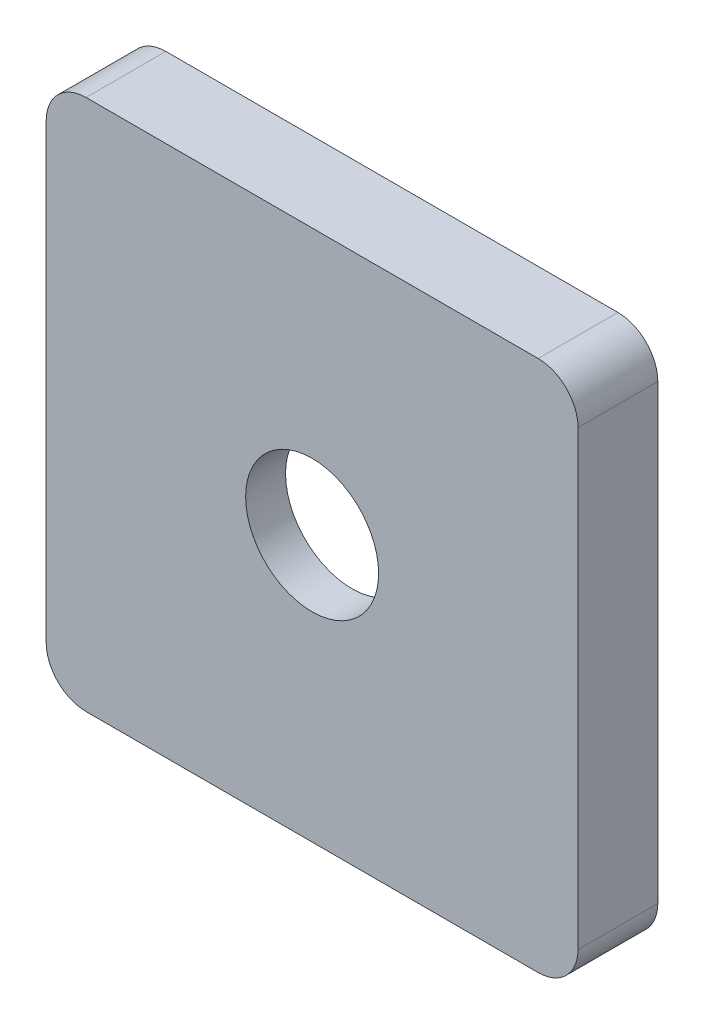
ISO-10303-21;
HEADER;
FILE_DESCRIPTION(('STEP AP214'),'2;1');
FILE_NAME('part.step','',(''),(''),'','','');
FILE_SCHEMA(('AUTOMOTIVE_DESIGN { 1 0 10303 214 1 1 1 1 }'));
ENDSEC;
DATA;
#1=APPLICATION_CONTEXT('core data for automotive mechanical design processes');
#2=APPLICATION_PROTOCOL_DEFINITION('international standard','automotive_design',2000,#1);
#3=PRODUCT_CONTEXT('',#1,'mechanical');
#4=PRODUCT('Part','Part','',(#3));
#5=PRODUCT_RELATED_PRODUCT_CATEGORY('part','',(#4));
#6=PRODUCT_DEFINITION_FORMATION('','',#4);
#7=PRODUCT_DEFINITION_CONTEXT('part definition',#1,'design');
#8=PRODUCT_DEFINITION('design','',#6,#7);
#9=PRODUCT_DEFINITION_SHAPE('','',#8);
#10=(LENGTH_UNIT() NAMED_UNIT(*) SI_UNIT(.MILLI.,.METRE.));
#11=(NAMED_UNIT(*) PLANE_ANGLE_UNIT() SI_UNIT($,.RADIAN.));
#12=(NAMED_UNIT(*) SI_UNIT($,.STERADIAN.) SOLID_ANGLE_UNIT());
#13=UNCERTAINTY_MEASURE_WITH_UNIT(LENGTH_MEASURE(1.E-05),#10,'distance_accuracy_value','');
#14=(GEOMETRIC_REPRESENTATION_CONTEXT(3) GLOBAL_UNCERTAINTY_ASSIGNED_CONTEXT((#13)) GLOBAL_UNIT_ASSIGNED_CONTEXT((#10,
#11,#12)) REPRESENTATION_CONTEXT('',''));
#15=CARTESIAN_POINT('',(0.,0.,0.));
#16=DIRECTION('',(0.,0.,1.));
#17=DIRECTION('',(1.,0.,0.));
#18=AXIS2_PLACEMENT_3D('',#15,#16,#17);
#19=CARTESIAN_POINT('',(0.,0.,1.5));
#20=DIRECTION('',(0.,0.,-1.));
#21=DIRECTION('',(-1.,0.,0.));
#22=AXIS2_PLACEMENT_3D('',#19,#20,#21);
#23=CYLINDRICAL_SURFACE('',#22,2.5);
#24=CARTESIAN_POINT('',(0.,0.,1.5));
#25=DIRECTION('',(0.,0.,1.));
#26=DIRECTION('',(1.,0.,0.));
#27=AXIS2_PLACEMENT_3D('',#24,#25,#26);
#28=CIRCLE('',#27,2.5);
#29=CARTESIAN_POINT('',(2.5,0.,1.5));
#30=VERTEX_POINT('',#29);
#31=EDGE_CURVE('E135',#30,#30,#28,.T.);
#32=ORIENTED_EDGE('',*,*,#31,.T.);
#33=EDGE_LOOP('',(#32));
#34=FACE_BOUND('',#33,.T.);
#35=CARTESIAN_POINT('',(0.,0.,0.));
#36=DIRECTION('',(0.,0.,-1.));
#37=DIRECTION('',(-1.,0.,0.));
#38=AXIS2_PLACEMENT_3D('',#35,#36,#37);
#39=CIRCLE('',#38,2.5);
#40=CARTESIAN_POINT('',(-2.5,0.,0.));
#41=VERTEX_POINT('',#40);
#42=EDGE_CURVE('E36',#41,#41,#39,.T.);
#43=ORIENTED_EDGE('',*,*,#42,.T.);
#44=EDGE_LOOP('',(#43));
#45=FACE_BOUND('',#44,.T.);
#46=ADVANCED_FACE('F32',(#34,#45),#23,.F.);
#47=CARTESIAN_POINT('',(-8.5,-8.5,1.5));
#48=DIRECTION('',(0.,0.,1.));
#49=DIRECTION('',(1.,0.,0.));
#50=AXIS2_PLACEMENT_3D('',#47,#48,#49);
#51=PLANE('',#50);
#52=CARTESIAN_POINT('',(-8.5,-8.5,1.5));
#53=DIRECTION('',(0.,0.,1.));
#54=DIRECTION('',(1.,0.,0.));
#55=AXIS2_PLACEMENT_3D('',#52,#53,#54);
#56=CIRCLE('',#55,1.5);
#57=CARTESIAN_POINT('',(-10.,-8.49999999999999,1.5));
#58=VERTEX_POINT('',#57);
#59=CARTESIAN_POINT('',(-8.49999999999999,-10.,1.5));
#60=VERTEX_POINT('',#59);
#61=EDGE_CURVE('E146',#58,#60,#56,.T.);
#62=ORIENTED_EDGE('',*,*,#61,.T.);
#63=DIRECTION('',(1.,0.,0.));
#64=VECTOR('',#63,1.);
#65=CARTESIAN_POINT('',(-8.49999999999999,-10.,1.5));
#66=LINE('',#65,#64);
#67=CARTESIAN_POINT('',(8.49999999999999,-10.,1.5));
#68=VERTEX_POINT('',#67);
#69=EDGE_CURVE('E93',#60,#68,#66,.T.);
#70=ORIENTED_EDGE('',*,*,#69,.T.);
#71=CARTESIAN_POINT('',(8.5,-8.5,1.5));
#72=DIRECTION('',(0.,0.,1.));
#73=DIRECTION('',(1.,0.,0.));
#74=AXIS2_PLACEMENT_3D('',#71,#72,#73);
#75=CIRCLE('',#74,1.5);
#76=CARTESIAN_POINT('',(10.,-8.49999999999999,1.5));
#77=VERTEX_POINT('',#76);
#78=EDGE_CURVE('E162',#68,#77,#75,.T.);
#79=ORIENTED_EDGE('',*,*,#78,.T.);
#80=DIRECTION('',(0.,1.,0.));
#81=VECTOR('',#80,1.);
#82=CARTESIAN_POINT('',(10.,8.49999999999999,1.5));
#83=LINE('',#82,#81);
#84=CARTESIAN_POINT('',(10.,8.49999999999999,1.5));
#85=VERTEX_POINT('',#84);
#86=EDGE_CURVE('E174',#77,#85,#83,.T.);
#87=ORIENTED_EDGE('',*,*,#86,.T.);
#88=CARTESIAN_POINT('',(8.5,8.5,1.5));
#89=DIRECTION('',(0.,0.,1.));
#90=DIRECTION('',(-1.,0.,0.));
#91=AXIS2_PLACEMENT_3D('',#88,#89,#90);
#92=CIRCLE('',#91,1.5);
#93=CARTESIAN_POINT('',(8.49999999999999,10.,1.5));
#94=VERTEX_POINT('',#93);
#95=EDGE_CURVE('E113',#85,#94,#92,.T.);
#96=ORIENTED_EDGE('',*,*,#95,.T.);
#97=DIRECTION('',(-1.,0.,0.));
#98=VECTOR('',#97,1.);
#99=CARTESIAN_POINT('',(-8.49999999999999,10.,1.5));
#100=LINE('',#99,#98);
#101=CARTESIAN_POINT('',(-8.49999999999999,10.,1.5));
#102=VERTEX_POINT('',#101);
#103=EDGE_CURVE('E106',#94,#102,#100,.T.);
#104=ORIENTED_EDGE('',*,*,#103,.T.);
#105=CARTESIAN_POINT('',(-8.5,8.5,1.5));
#106=DIRECTION('',(0.,0.,1.));
#107=DIRECTION('',(1.,0.,0.));
#108=AXIS2_PLACEMENT_3D('',#105,#106,#107);
#109=CIRCLE('',#108,1.5);
#110=CARTESIAN_POINT('',(-10.,8.49999999999999,1.5));
#111=VERTEX_POINT('',#110);
#112=EDGE_CURVE('E111',#102,#111,#109,.T.);
#113=ORIENTED_EDGE('',*,*,#112,.T.);
#114=DIRECTION('',(0.,-1.,0.));
#115=VECTOR('',#114,1.);
#116=CARTESIAN_POINT('',(-10.,8.49999999999999,1.5));
#117=LINE('',#116,#115);
#118=EDGE_CURVE('E50',#111,#58,#117,.T.);
#119=ORIENTED_EDGE('',*,*,#118,.T.);
#120=EDGE_LOOP('',(#62,#70,#79,#87,#96,#104,#113,#119));
#121=FACE_BOUND('',#120,.T.);
#122=ORIENTED_EDGE('',*,*,#31,.F.);
#123=EDGE_LOOP('',(#122));
#124=FACE_BOUND('',#123,.T.);
#125=ADVANCED_FACE('F108',(#121,#124),#51,.T.);
#126=CARTESIAN_POINT('',(-8.5,-8.5,-1.5));
#127=DIRECTION('',(0.,0.,1.));
#128=DIRECTION('',(1.,0.,0.));
#129=AXIS2_PLACEMENT_3D('',#126,#127,#128);
#130=PLANE('',#129);
#131=CARTESIAN_POINT('',(0.,0.,-1.5));
#132=DIRECTION('',(0.,0.,-1.));
#133=DIRECTION('',(-1.,0.,0.));
#134=AXIS2_PLACEMENT_3D('',#131,#132,#133);
#135=CIRCLE('',#134,5.);
#136=CARTESIAN_POINT('',(-5.,0.,-1.5));
#137=VERTEX_POINT('',#136);
#138=EDGE_CURVE('E182',#137,#137,#135,.T.);
#139=ORIENTED_EDGE('',*,*,#138,.F.);
#140=EDGE_LOOP('',(#139));
#141=FACE_BOUND('',#140,.T.);
#142=CARTESIAN_POINT('',(-8.5,-8.5,-1.5));
#143=DIRECTION('',(0.,0.,1.));
#144=DIRECTION('',(1.,0.,0.));
#145=AXIS2_PLACEMENT_3D('',#142,#143,#144);
#146=CIRCLE('',#145,1.5);
#147=CARTESIAN_POINT('',(-10.,-8.49999999999999,-1.5));
#148=VERTEX_POINT('',#147);
#149=CARTESIAN_POINT('',(-8.49999999999999,-10.,-1.5));
#150=VERTEX_POINT('',#149);
#151=EDGE_CURVE('E131',#148,#150,#146,.T.);
#152=ORIENTED_EDGE('',*,*,#151,.F.);
#153=DIRECTION('',(0.,-1.,0.));
#154=VECTOR('',#153,1.);
#155=CARTESIAN_POINT('',(-10.,8.49999999999999,-1.5));
#156=LINE('',#155,#154);
#157=CARTESIAN_POINT('',(-10.,8.49999999999999,-1.5));
#158=VERTEX_POINT('',#157);
#159=EDGE_CURVE('E85',#158,#148,#156,.T.);
#160=ORIENTED_EDGE('',*,*,#159,.F.);
#161=CARTESIAN_POINT('',(-8.5,8.5,-1.5));
#162=DIRECTION('',(0.,0.,1.));
#163=DIRECTION('',(1.,0.,0.));
#164=AXIS2_PLACEMENT_3D('',#161,#162,#163);
#165=CIRCLE('',#164,1.5);
#166=CARTESIAN_POINT('',(-8.49999999999999,10.,-1.5));
#167=VERTEX_POINT('',#166);
#168=EDGE_CURVE('E79',#167,#158,#165,.T.);
#169=ORIENTED_EDGE('',*,*,#168,.F.);
#170=DIRECTION('',(-1.,0.,0.));
#171=VECTOR('',#170,1.);
#172=CARTESIAN_POINT('',(-8.49999999999999,10.,-1.5));
#173=LINE('',#172,#171);
#174=CARTESIAN_POINT('',(8.49999999999999,10.,-1.5));
#175=VERTEX_POINT('',#174);
#176=EDGE_CURVE('E121',#175,#167,#173,.T.);
#177=ORIENTED_EDGE('',*,*,#176,.F.);
#178=CARTESIAN_POINT('',(8.5,8.5,-1.5));
#179=DIRECTION('',(0.,0.,1.));
#180=DIRECTION('',(-1.,0.,0.));
#181=AXIS2_PLACEMENT_3D('',#178,#179,#180);
#182=CIRCLE('',#181,1.5);
#183=CARTESIAN_POINT('',(10.,8.49999999999999,-1.5));
#184=VERTEX_POINT('',#183);
#185=EDGE_CURVE('E141',#184,#175,#182,.T.);
#186=ORIENTED_EDGE('',*,*,#185,.F.);
#187=DIRECTION('',(0.,1.,0.));
#188=VECTOR('',#187,1.);
#189=CARTESIAN_POINT('',(10.,8.49999999999999,-1.5));
#190=LINE('',#189,#188);
#191=CARTESIAN_POINT('',(10.,-8.49999999999999,-1.5));
#192=VERTEX_POINT('',#191);
#193=EDGE_CURVE('E139',#192,#184,#190,.T.);
#194=ORIENTED_EDGE('',*,*,#193,.F.);
#195=CARTESIAN_POINT('',(8.5,-8.5,-1.5));
#196=DIRECTION('',(0.,0.,1.));
#197=DIRECTION('',(1.,0.,0.));
#198=AXIS2_PLACEMENT_3D('',#195,#196,#197);
#199=CIRCLE('',#198,1.5);
#200=CARTESIAN_POINT('',(8.49999999999999,-10.,-1.5));
#201=VERTEX_POINT('',#200);
#202=EDGE_CURVE('E137',#201,#192,#199,.T.);
#203=ORIENTED_EDGE('',*,*,#202,.F.);
#204=DIRECTION('',(1.,0.,0.));
#205=VECTOR('',#204,1.);
#206=CARTESIAN_POINT('',(-8.49999999999999,-10.,-1.5));
#207=LINE('',#206,#205);
#208=EDGE_CURVE('E134',#150,#201,#207,.T.);
#209=ORIENTED_EDGE('',*,*,#208,.F.);
#210=EDGE_LOOP('',(#152,#160,#169,#177,#186,#194,#203,#209));
#211=FACE_BOUND('',#210,.T.);
#212=ADVANCED_FACE('F166',(#141,#211),#130,.F.);
#213=CARTESIAN_POINT('',(-8.5,-8.5,1.5));
#214=DIRECTION('',(0.,0.,-1.));
#215=DIRECTION('',(-1.,0.,0.));
#216=AXIS2_PLACEMENT_3D('',#213,#214,#215);
#217=CYLINDRICAL_SURFACE('',#216,1.5);
#218=ORIENTED_EDGE('',*,*,#151,.T.);
#219=DIRECTION('',(0.,0.,-1.));
#220=VECTOR('',#219,1.);
#221=CARTESIAN_POINT('',(-8.49999999999999,-10.,1.5));
#222=LINE('',#221,#220);
#223=EDGE_CURVE('E11',#60,#150,#222,.T.);
#224=ORIENTED_EDGE('',*,*,#223,.F.);
#225=ORIENTED_EDGE('',*,*,#61,.F.);
#226=DIRECTION('',(0.,0.,-1.));
#227=VECTOR('',#226,1.);
#228=CARTESIAN_POINT('',(-10.,-8.49999999999999,1.5));
#229=LINE('',#228,#227);
#230=EDGE_CURVE('E127',#58,#148,#229,.T.);
#231=ORIENTED_EDGE('',*,*,#230,.T.);
#232=EDGE_LOOP('',(#218,#224,#225,#231));
#233=FACE_BOUND('',#232,.T.);
#234=ADVANCED_FACE('F34',(#233),#217,.T.);
#235=CARTESIAN_POINT('',(-8.49999999999999,-10.,1.5));
#236=DIRECTION('',(0.,1.,0.));
#237=DIRECTION('',(0.,0.,1.));
#238=AXIS2_PLACEMENT_3D('',#235,#236,#237);
#239=PLANE('',#238);
#240=ORIENTED_EDGE('',*,*,#208,.T.);
#241=DIRECTION('',(0.,0.,-1.));
#242=VECTOR('',#241,1.);
#243=CARTESIAN_POINT('',(8.49999999999999,-10.,1.5));
#244=LINE('',#243,#242);
#245=EDGE_CURVE('E42',#68,#201,#244,.T.);
#246=ORIENTED_EDGE('',*,*,#245,.F.);
#247=ORIENTED_EDGE('',*,*,#69,.F.);
#248=ORIENTED_EDGE('',*,*,#223,.T.);
#249=EDGE_LOOP('',(#240,#246,#247,#248));
#250=FACE_BOUND('',#249,.T.);
#251=ADVANCED_FACE('F225',(#250),#239,.F.);
#252=CARTESIAN_POINT('',(8.5,-8.5,1.5));
#253=DIRECTION('',(0.,0.,-1.));
#254=DIRECTION('',(-1.,0.,0.));
#255=AXIS2_PLACEMENT_3D('',#252,#253,#254);
#256=CYLINDRICAL_SURFACE('',#255,1.5);
#257=ORIENTED_EDGE('',*,*,#202,.T.);
#258=DIRECTION('',(0.,0.,-1.));
#259=VECTOR('',#258,1.);
#260=CARTESIAN_POINT('',(10.,-8.49999999999999,1.5));
#261=LINE('',#260,#259);
#262=EDGE_CURVE('E153',#77,#192,#261,.T.);
#263=ORIENTED_EDGE('',*,*,#262,.F.);
#264=ORIENTED_EDGE('',*,*,#78,.F.);
#265=ORIENTED_EDGE('',*,*,#245,.T.);
#266=EDGE_LOOP('',(#257,#263,#264,#265));
#267=FACE_BOUND('',#266,.T.);
#268=ADVANCED_FACE('F160',(#267),#256,.T.);
#269=CARTESIAN_POINT('',(10.,8.49999999999999,1.5));
#270=DIRECTION('',(-1.,0.,0.));
#271=DIRECTION('',(0.,-1.,0.));
#272=AXIS2_PLACEMENT_3D('',#269,#270,#271);
#273=PLANE('',#272);
#274=ORIENTED_EDGE('',*,*,#193,.T.);
#275=DIRECTION('',(0.,0.,-1.));
#276=VECTOR('',#275,1.);
#277=CARTESIAN_POINT('',(10.,8.49999999999999,1.5));
#278=LINE('',#277,#276);
#279=EDGE_CURVE('E150',#85,#184,#278,.T.);
#280=ORIENTED_EDGE('',*,*,#279,.F.);
#281=ORIENTED_EDGE('',*,*,#86,.F.);
#282=ORIENTED_EDGE('',*,*,#262,.T.);
#283=EDGE_LOOP('',(#274,#280,#281,#282));
#284=FACE_BOUND('',#283,.T.);
#285=ADVANCED_FACE('F170',(#284),#273,.F.);
#286=CARTESIAN_POINT('',(8.5,8.5,1.5));
#287=DIRECTION('',(0.,0.,-1.));
#288=DIRECTION('',(-1.,0.,0.));
#289=AXIS2_PLACEMENT_3D('',#286,#287,#288);
#290=CYLINDRICAL_SURFACE('',#289,1.5);
#291=ORIENTED_EDGE('',*,*,#185,.T.);
#292=DIRECTION('',(0.,0.,-1.));
#293=VECTOR('',#292,1.);
#294=CARTESIAN_POINT('',(8.49999999999999,10.,1.5));
#295=LINE('',#294,#293);
#296=EDGE_CURVE('E122',#94,#175,#295,.T.);
#297=ORIENTED_EDGE('',*,*,#296,.F.);
#298=ORIENTED_EDGE('',*,*,#95,.F.);
#299=ORIENTED_EDGE('',*,*,#279,.T.);
#300=EDGE_LOOP('',(#291,#297,#298,#299));
#301=FACE_BOUND('',#300,.T.);
#302=ADVANCED_FACE('F173',(#301),#290,.T.);
#303=CARTESIAN_POINT('',(-8.49999999999999,10.,1.5));
#304=DIRECTION('',(0.,-1.,0.));
#305=DIRECTION('',(0.,0.,-1.));
#306=AXIS2_PLACEMENT_3D('',#303,#304,#305);
#307=PLANE('',#306);
#308=ORIENTED_EDGE('',*,*,#176,.T.);
#309=DIRECTION('',(0.,0.,-1.));
#310=VECTOR('',#309,1.);
#311=CARTESIAN_POINT('',(-8.49999999999999,10.,1.5));
#312=LINE('',#311,#310);
#313=EDGE_CURVE('E118',#102,#167,#312,.T.);
#314=ORIENTED_EDGE('',*,*,#313,.F.);
#315=ORIENTED_EDGE('',*,*,#103,.F.);
#316=ORIENTED_EDGE('',*,*,#296,.T.);
#317=EDGE_LOOP('',(#308,#314,#315,#316));
#318=FACE_BOUND('',#317,.T.);
#319=ADVANCED_FACE('F119',(#318),#307,.F.);
#320=CARTESIAN_POINT('',(-8.5,8.5,1.5));
#321=DIRECTION('',(0.,0.,-1.));
#322=DIRECTION('',(-1.,0.,0.));
#323=AXIS2_PLACEMENT_3D('',#320,#321,#322);
#324=CYLINDRICAL_SURFACE('',#323,1.5);
#325=ORIENTED_EDGE('',*,*,#168,.T.);
#326=DIRECTION('',(0.,0.,-1.));
#327=VECTOR('',#326,1.);
#328=CARTESIAN_POINT('',(-10.,8.49999999999999,1.5));
#329=LINE('',#328,#327);
#330=EDGE_CURVE('E123',#111,#158,#329,.T.);
#331=ORIENTED_EDGE('',*,*,#330,.F.);
#332=ORIENTED_EDGE('',*,*,#112,.F.);
#333=ORIENTED_EDGE('',*,*,#313,.T.);
#334=EDGE_LOOP('',(#325,#331,#332,#333));
#335=FACE_BOUND('',#334,.T.);
#336=ADVANCED_FACE('F125',(#335),#324,.T.);
#337=CARTESIAN_POINT('',(-10.,8.49999999999999,1.5));
#338=DIRECTION('',(1.,0.,0.));
#339=DIRECTION('',(0.,0.,-1.));
#340=AXIS2_PLACEMENT_3D('',#337,#338,#339);
#341=PLANE('',#340);
#342=ORIENTED_EDGE('',*,*,#159,.T.);
#343=ORIENTED_EDGE('',*,*,#230,.F.);
#344=ORIENTED_EDGE('',*,*,#118,.F.);
#345=ORIENTED_EDGE('',*,*,#330,.T.);
#346=EDGE_LOOP('',(#342,#343,#344,#345));
#347=FACE_BOUND('',#346,.T.);
#348=ADVANCED_FACE('F200',(#347),#341,.F.);
#349=CARTESIAN_POINT('',(0.,0.,0.));
#350=DIRECTION('',(0.,0.,-1.));
#351=DIRECTION('',(-1.,0.,0.));
#352=AXIS2_PLACEMENT_3D('',#349,#350,#351);
#353=CYLINDRICAL_SURFACE('',#352,5.);
#354=CARTESIAN_POINT('',(0.,0.,0.));
#355=DIRECTION('',(0.,0.,-1.));
#356=DIRECTION('',(-1.,0.,0.));
#357=AXIS2_PLACEMENT_3D('',#354,#355,#356);
#358=CIRCLE('',#357,5.);
#359=CARTESIAN_POINT('',(-5.,0.,0.));
#360=VERTEX_POINT('',#359);
#361=EDGE_CURVE('E185',#360,#360,#358,.T.);
#362=ORIENTED_EDGE('',*,*,#361,.F.);
#363=EDGE_LOOP('',(#362));
#364=FACE_BOUND('',#363,.T.);
#365=ORIENTED_EDGE('',*,*,#138,.T.);
#366=EDGE_LOOP('',(#365));
#367=FACE_BOUND('',#366,.T.);
#368=ADVANCED_FACE('F195',(#364,#367),#353,.F.);
#369=CARTESIAN_POINT('',(0.,0.,0.));
#370=DIRECTION('',(0.,0.,-1.));
#371=DIRECTION('',(-1.,0.,0.));
#372=AXIS2_PLACEMENT_3D('',#369,#370,#371);
#373=PLANE('',#372);
#374=ORIENTED_EDGE('',*,*,#42,.F.);
#375=EDGE_LOOP('',(#374));
#376=FACE_BOUND('',#375,.T.);
#377=ORIENTED_EDGE('',*,*,#361,.T.);
#378=EDGE_LOOP('',(#377));
#379=FACE_BOUND('',#378,.T.);
#380=ADVANCED_FACE('F193',(#376,#379),#373,.T.);
#381=CLOSED_SHELL('',(#46,#125,#212,#234,#251,#268,#285,#302,#319,#336,#348,#368,#380));
#382=MANIFOLD_SOLID_BREP('B2',#381);
#383=ADVANCED_BREP_SHAPE_REPRESENTATION('',(#18,#382),#14);
#384=SHAPE_DEFINITION_REPRESENTATION(#9,#383);
ENDSEC;
END-ISO-10303-21;
